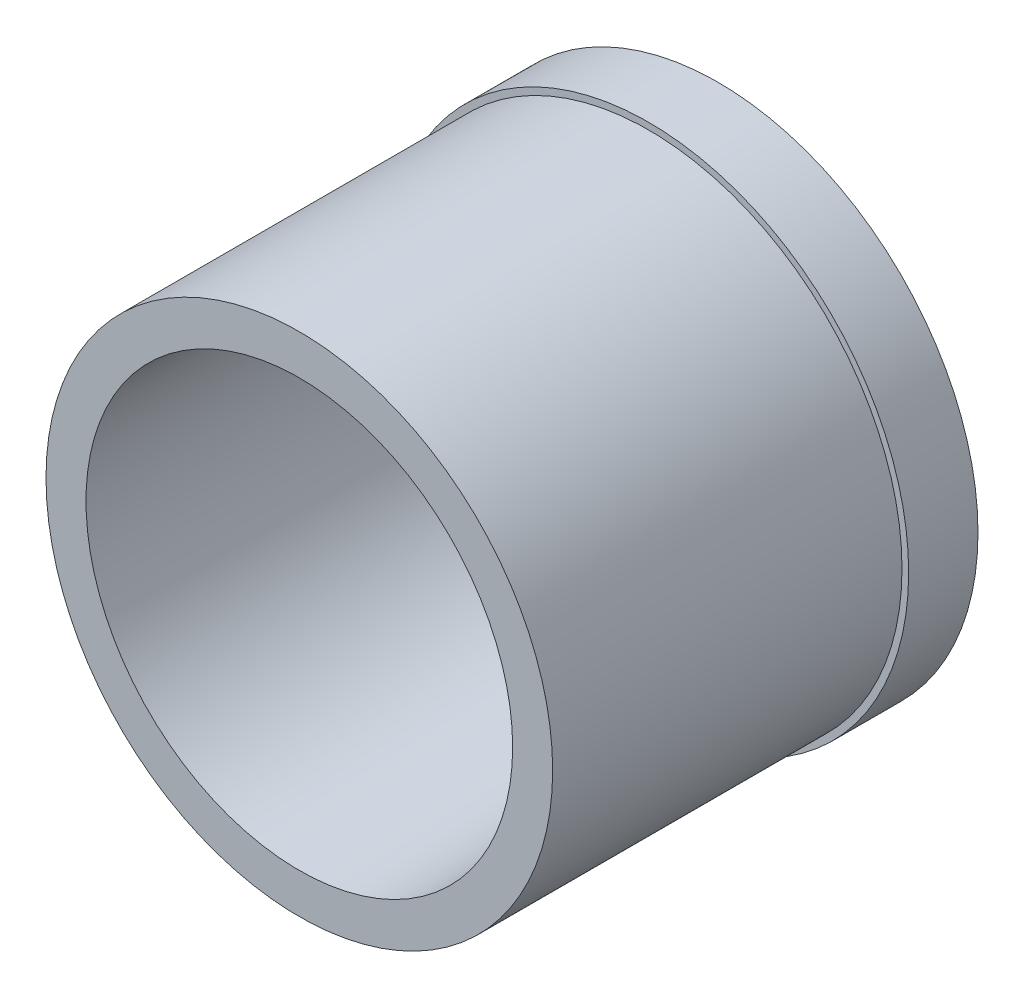
ISO-10303-21;
HEADER;
FILE_DESCRIPTION(('STEP AP214'),'2;1');
FILE_NAME('part.step','',(''),(''),'','','');
FILE_SCHEMA(('AUTOMOTIVE_DESIGN { 1 0 10303 214 1 1 1 1 }'));
ENDSEC;
DATA;
#1=APPLICATION_CONTEXT('core data for automotive mechanical design processes');
#2=APPLICATION_PROTOCOL_DEFINITION('international standard','automotive_design',2000,#1);
#3=PRODUCT_CONTEXT('',#1,'mechanical');
#4=PRODUCT('Part','Part','',(#3));
#5=PRODUCT_RELATED_PRODUCT_CATEGORY('part','',(#4));
#6=PRODUCT_DEFINITION_FORMATION('','',#4);
#7=PRODUCT_DEFINITION_CONTEXT('part definition',#1,'design');
#8=PRODUCT_DEFINITION('design','',#6,#7);
#9=PRODUCT_DEFINITION_SHAPE('','',#8);
#10=(LENGTH_UNIT() NAMED_UNIT(*) SI_UNIT(.MILLI.,.METRE.));
#11=(NAMED_UNIT(*) PLANE_ANGLE_UNIT() SI_UNIT($,.RADIAN.));
#12=(NAMED_UNIT(*) SI_UNIT($,.STERADIAN.) SOLID_ANGLE_UNIT());
#13=UNCERTAINTY_MEASURE_WITH_UNIT(LENGTH_MEASURE(1.E-05),#10,'distance_accuracy_value','');
#14=(GEOMETRIC_REPRESENTATION_CONTEXT(3) GLOBAL_UNCERTAINTY_ASSIGNED_CONTEXT((#13)) GLOBAL_UNIT_ASSIGNED_CONTEXT((#10,
#11,#12)) REPRESENTATION_CONTEXT('',''));
#15=CARTESIAN_POINT('',(0.,0.,0.));
#16=DIRECTION('',(0.,0.,1.));
#17=DIRECTION('',(1.,0.,0.));
#18=AXIS2_PLACEMENT_3D('',#15,#16,#17);
#19=CARTESIAN_POINT('',(0.,-19.812,-20.6375));
#20=DIRECTION('',(0.,0.,-1.));
#21=DIRECTION('',(-1.,0.,0.));
#22=AXIS2_PLACEMENT_3D('',#19,#20,#21);
#23=PLANE('',#22);
#24=CARTESIAN_POINT('',(0.,0.,-20.6375));
#25=DIRECTION('',(0.,0.,1.));
#26=DIRECTION('',(1.,0.,0.));
#27=AXIS2_PLACEMENT_3D('',#24,#25,#26);
#28=CIRCLE('',#27,19.812);
#29=CARTESIAN_POINT('',(19.812,0.,-20.6375));
#30=VERTEX_POINT('',#29);
#31=EDGE_CURVE('E118',#30,#30,#28,.T.);
#32=ORIENTED_EDGE('',*,*,#31,.F.);
#33=EDGE_LOOP('',(#32));
#34=FACE_BOUND('',#33,.T.);
#35=ADVANCED_FACE('F18',(#34),#23,.T.);
#36=CARTESIAN_POINT('',(0.,0.,20.6375));
#37=DIRECTION('',(0.,0.,1.));
#38=DIRECTION('',(1.,0.,0.));
#39=AXIS2_PLACEMENT_3D('',#36,#37,#38);
#40=CYLINDRICAL_SURFACE('',#39,19.812);
#41=ORIENTED_EDGE('',*,*,#31,.T.);
#42=EDGE_LOOP('',(#41));
#43=FACE_BOUND('',#42,.T.);
#44=CARTESIAN_POINT('',(0.,0.,-19.2405));
#45=DIRECTION('',(0.,0.,1.));
#46=DIRECTION('',(1.,0.,0.));
#47=AXIS2_PLACEMENT_3D('',#44,#45,#46);
#48=CIRCLE('',#47,19.812);
#49=CARTESIAN_POINT('',(19.812,0.,-19.2405));
#50=VERTEX_POINT('',#49);
#51=EDGE_CURVE('E42',#50,#50,#48,.T.);
#52=ORIENTED_EDGE('',*,*,#51,.F.);
#53=EDGE_LOOP('',(#52));
#54=FACE_BOUND('',#53,.T.);
#55=ADVANCED_FACE('F64',(#43,#54),#40,.T.);
#56=CARTESIAN_POINT('',(0.,0.,-14.6685));
#57=DIRECTION('',(0.,0.,1.));
#58=DIRECTION('',(1.,0.,0.));
#59=AXIS2_PLACEMENT_3D('',#56,#57,#58);
#60=PLANE('',#59);
#61=CARTESIAN_POINT('',(0.,0.,-14.6685));
#62=DIRECTION('',(0.,0.,-1.));
#63=DIRECTION('',(-1.,0.,0.));
#64=AXIS2_PLACEMENT_3D('',#61,#62,#63);
#65=CIRCLE('',#64,17.6153776195186);
#66=CARTESIAN_POINT('',(17.6153776195186,0.,-14.6685));
#67=VERTEX_POINT('',#66);
#68=CARTESIAN_POINT('',(-17.6153776195186,0.,-14.6685));
#69=VERTEX_POINT('',#68);
#70=EDGE_CURVE('E35',#67,#69,#65,.F.);
#71=ORIENTED_EDGE('',*,*,#70,.T.);
#72=CARTESIAN_POINT('',(0.,0.,-14.6685));
#73=DIRECTION('',(0.,0.,-1.));
#74=DIRECTION('',(1.,0.,0.));
#75=AXIS2_PLACEMENT_3D('',#72,#73,#74);
#76=CIRCLE('',#75,17.6153776195186);
#77=EDGE_CURVE('E40',#69,#67,#76,.F.);
#78=ORIENTED_EDGE('',*,*,#77,.T.);
#79=EDGE_LOOP('',(#71,#78));
#80=FACE_BOUND('',#79,.T.);
#81=ADVANCED_FACE('F45',(#80),#60,.T.);
#82=CARTESIAN_POINT('',(0.,-19.812,-19.2405));
#83=DIRECTION('',(0.,0.,-1.));
#84=DIRECTION('',(-1.,0.,0.));
#85=AXIS2_PLACEMENT_3D('',#82,#83,#84);
#86=PLANE('',#85);
#87=CARTESIAN_POINT('',(0.,0.,-19.2405));
#88=DIRECTION('',(0.,0.,1.));
#89=DIRECTION('',(1.,0.,0.));
#90=AXIS2_PLACEMENT_3D('',#87,#88,#89);
#91=CIRCLE('',#90,24.765);
#92=CARTESIAN_POINT('',(24.765,0.,-19.2405));
#93=VERTEX_POINT('',#92);
#94=EDGE_CURVE('E46',#93,#93,#91,.T.);
#95=ORIENTED_EDGE('',*,*,#94,.F.);
#96=EDGE_LOOP('',(#95));
#97=FACE_BOUND('',#96,.T.);
#98=ORIENTED_EDGE('',*,*,#51,.T.);
#99=EDGE_LOOP('',(#98));
#100=FACE_BOUND('',#99,.T.);
#101=ADVANCED_FACE('F63',(#97,#100),#86,.T.);
#102=CARTESIAN_POINT('',(0.,0.,-13.1445));
#103=DIRECTION('',(0.,0.,1.));
#104=DIRECTION('',(1.,0.,0.));
#105=AXIS2_PLACEMENT_3D('',#102,#103,#104);
#106=TOROIDAL_SURFACE('',#105,17.6153776195186,1.524);
#107=CARTESIAN_POINT('',(0.,0.,-13.1976868329745));
#108=DIRECTION('',(0.,0.,1.));
#109=DIRECTION('',(1.,0.,0.));
#110=AXIS2_PLACEMENT_3D('',#107,#108,#109);
#111=CIRCLE('',#110,19.1384492398957);
#112=CARTESIAN_POINT('',(19.1384492398957,0.,-13.1976868329746));
#113=VERTEX_POINT('',#112);
#114=EDGE_CURVE('E105',#113,#113,#111,.T.);
#115=ORIENTED_EDGE('',*,*,#114,.T.);
#116=EDGE_LOOP('',(#115));
#117=FACE_BOUND('',#116,.T.);
#118=ORIENTED_EDGE('',*,*,#77,.F.);
#119=ORIENTED_EDGE('',*,*,#70,.F.);
#120=EDGE_LOOP('',(#118,#119));
#121=FACE_BOUND('',#120,.T.);
#122=ADVANCED_FACE('F39',(#117,#121),#106,.F.);
#123=CARTESIAN_POINT('',(0.,0.,20.6375));
#124=DIRECTION('',(0.,0.,1.));
#125=DIRECTION('',(1.,0.,0.));
#126=AXIS2_PLACEMENT_3D('',#123,#124,#125);
#127=CYLINDRICAL_SURFACE('',#126,24.765);
#128=ORIENTED_EDGE('',*,*,#94,.T.);
#129=EDGE_LOOP('',(#128));
#130=FACE_BOUND('',#129,.T.);
#131=CARTESIAN_POINT('',(0.,0.,-12.6365));
#132=DIRECTION('',(0.,0.,1.));
#133=DIRECTION('',(1.,0.,0.));
#134=AXIS2_PLACEMENT_3D('',#131,#132,#133);
#135=CIRCLE('',#134,24.765);
#136=CARTESIAN_POINT('',(24.765,0.,-12.6365));
#137=VERTEX_POINT('',#136);
#138=EDGE_CURVE('E107',#137,#137,#135,.T.);
#139=ORIENTED_EDGE('',*,*,#138,.F.);
#140=EDGE_LOOP('',(#139));
#141=FACE_BOUND('',#140,.T.);
#142=ADVANCED_FACE('F94',(#130,#141),#127,.T.);
#143=CARTESIAN_POINT('',(0.,0.,20.6375));
#144=DIRECTION('',(0.,0.,1.));
#145=DIRECTION('',(1.,0.,0.));
#146=AXIS2_PLACEMENT_3D('',#143,#144,#145);
#147=CONICAL_SURFACE('',#146,20.32,0.0349065850398797);
#148=CARTESIAN_POINT('',(0.,0.,20.6375));
#149=DIRECTION('',(0.,0.,1.));
#150=DIRECTION('',(1.,0.,0.));
#151=AXIS2_PLACEMENT_3D('',#148,#149,#150);
#152=CIRCLE('',#151,20.32);
#153=CARTESIAN_POINT('',(20.32,0.,20.6375));
#154=VERTEX_POINT('',#153);
#155=EDGE_CURVE('E110',#154,#154,#152,.F.);
#156=ORIENTED_EDGE('',*,*,#155,.F.);
#157=EDGE_LOOP('',(#156));
#158=FACE_BOUND('',#157,.T.);
#159=ORIENTED_EDGE('',*,*,#114,.F.);
#160=EDGE_LOOP('',(#159));
#161=FACE_BOUND('',#160,.T.);
#162=ADVANCED_FACE('F90',(#158,#161),#147,.F.);
#163=CARTESIAN_POINT('',(0.,-24.13,-12.6365));
#164=DIRECTION('',(0.,0.,1.));
#165=DIRECTION('',(1.,0.,0.));
#166=AXIS2_PLACEMENT_3D('',#163,#164,#165);
#167=PLANE('',#166);
#168=CARTESIAN_POINT('',(0.,0.,-12.6365));
#169=DIRECTION('',(0.,0.,1.));
#170=DIRECTION('',(1.,0.,0.));
#171=AXIS2_PLACEMENT_3D('',#168,#169,#170);
#172=CIRCLE('',#171,24.13);
#173=CARTESIAN_POINT('',(24.13,0.,-12.6365));
#174=VERTEX_POINT('',#173);
#175=EDGE_CURVE('E29',#174,#174,#172,.T.);
#176=ORIENTED_EDGE('',*,*,#175,.F.);
#177=EDGE_LOOP('',(#176));
#178=FACE_BOUND('',#177,.T.);
#179=ORIENTED_EDGE('',*,*,#138,.T.);
#180=EDGE_LOOP('',(#179));
#181=FACE_BOUND('',#180,.T.);
#182=ADVANCED_FACE('F83',(#178,#181),#167,.T.);
#183=CARTESIAN_POINT('',(0.,-24.13,20.6375));
#184=DIRECTION('',(0.,0.,1.));
#185=DIRECTION('',(1.,0.,0.));
#186=AXIS2_PLACEMENT_3D('',#183,#184,#185);
#187=PLANE('',#186);
#188=ORIENTED_EDGE('',*,*,#155,.T.);
#189=EDGE_LOOP('',(#188));
#190=FACE_BOUND('',#189,.T.);
#191=CARTESIAN_POINT('',(0.,0.,20.6375));
#192=DIRECTION('',(0.,0.,1.));
#193=DIRECTION('',(1.,0.,0.));
#194=AXIS2_PLACEMENT_3D('',#191,#192,#193);
#195=CIRCLE('',#194,24.13);
#196=CARTESIAN_POINT('',(24.13,0.,20.6375));
#197=VERTEX_POINT('',#196);
#198=EDGE_CURVE('E11',#197,#197,#195,.F.);
#199=ORIENTED_EDGE('',*,*,#198,.F.);
#200=EDGE_LOOP('',(#199));
#201=FACE_BOUND('',#200,.T.);
#202=ADVANCED_FACE('F77',(#190,#201),#187,.T.);
#203=CARTESIAN_POINT('',(0.,0.,20.6375));
#204=DIRECTION('',(0.,0.,1.));
#205=DIRECTION('',(1.,0.,0.));
#206=AXIS2_PLACEMENT_3D('',#203,#204,#205);
#207=CYLINDRICAL_SURFACE('',#206,24.13);
#208=ORIENTED_EDGE('',*,*,#198,.T.);
#209=EDGE_LOOP('',(#208));
#210=FACE_BOUND('',#209,.T.);
#211=ORIENTED_EDGE('',*,*,#175,.T.);
#212=EDGE_LOOP('',(#211));
#213=FACE_BOUND('',#212,.T.);
#214=ADVANCED_FACE('F75',(#210,#213),#207,.T.);
#215=CLOSED_SHELL('',(#35,#55,#81,#101,#122,#142,#162,#182,#202,#214));
#216=MANIFOLD_SOLID_BREP('B1',#215);
#217=ADVANCED_BREP_SHAPE_REPRESENTATION('',(#18,#216),#14);
#218=SHAPE_DEFINITION_REPRESENTATION(#9,#217);
ENDSEC;
END-ISO-10303-21;
